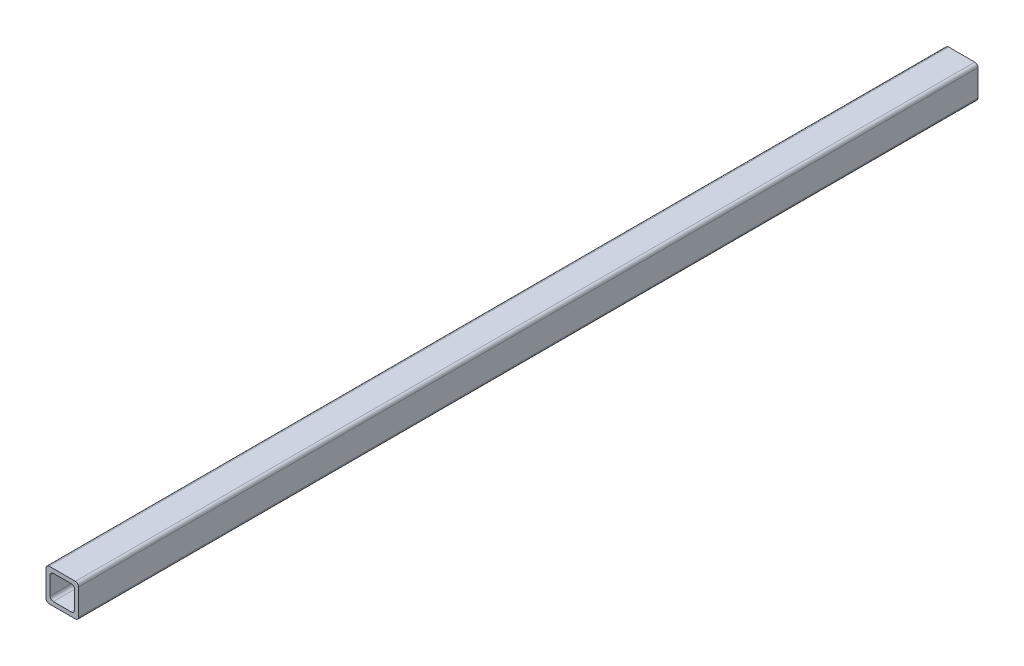
ISO-10303-21;
HEADER;
FILE_DESCRIPTION(('STEP AP214'),'2;1');
FILE_NAME('part.step','',(''),(''),'','','');
FILE_SCHEMA(('AUTOMOTIVE_DESIGN { 1 0 10303 214 1 1 1 1 }'));
ENDSEC;
DATA;
#1=APPLICATION_CONTEXT('core data for automotive mechanical design processes');
#2=APPLICATION_PROTOCOL_DEFINITION('international standard','automotive_design',2000,#1);
#3=PRODUCT_CONTEXT('',#1,'mechanical');
#4=PRODUCT('Part','Part','',(#3));
#5=PRODUCT_RELATED_PRODUCT_CATEGORY('part','',(#4));
#6=PRODUCT_DEFINITION_FORMATION('','',#4);
#7=PRODUCT_DEFINITION_CONTEXT('part definition',#1,'design');
#8=PRODUCT_DEFINITION('design','',#6,#7);
#9=PRODUCT_DEFINITION_SHAPE('','',#8);
#10=(LENGTH_UNIT() NAMED_UNIT(*) SI_UNIT(.MILLI.,.METRE.));
#11=(NAMED_UNIT(*) PLANE_ANGLE_UNIT() SI_UNIT($,.RADIAN.));
#12=(NAMED_UNIT(*) SI_UNIT($,.STERADIAN.) SOLID_ANGLE_UNIT());
#13=UNCERTAINTY_MEASURE_WITH_UNIT(LENGTH_MEASURE(1.E-05),#10,'distance_accuracy_value','');
#14=(GEOMETRIC_REPRESENTATION_CONTEXT(3) GLOBAL_UNCERTAINTY_ASSIGNED_CONTEXT((#13)) GLOBAL_UNIT_ASSIGNED_CONTEXT((#10,
#11,#12)) REPRESENTATION_CONTEXT('',''));
#15=CARTESIAN_POINT('',(0.,0.,0.));
#16=DIRECTION('',(0.,0.,1.));
#17=DIRECTION('',(1.,0.,0.));
#18=AXIS2_PLACEMENT_3D('',#15,#16,#17);
#19=CARTESIAN_POINT('',(10.2,-10.2,700.));
#20=DIRECTION('',(0.,0.,-1.));
#21=DIRECTION('',(-1.,0.,0.));
#22=AXIS2_PLACEMENT_3D('',#19,#20,#21);
#23=PLANE('',#22);
#24=CARTESIAN_POINT('',(10.2,-10.2,700.));
#25=DIRECTION('',(0.,0.,1.));
#26=DIRECTION('',(-1.,0.,0.));
#27=AXIS2_PLACEMENT_3D('',#24,#25,#26);
#28=CIRCLE('',#27,2.5);
#29=CARTESIAN_POINT('',(10.2,-12.7,700.));
#30=VERTEX_POINT('',#29);
#31=CARTESIAN_POINT('',(12.7,-10.2,700.));
#32=VERTEX_POINT('',#31);
#33=EDGE_CURVE('E215',#30,#32,#28,.T.);
#34=ORIENTED_EDGE('',*,*,#33,.T.);
#35=DIRECTION('',(0.,1.,0.));
#36=VECTOR('',#35,1.);
#37=CARTESIAN_POINT('',(12.7,-10.2,700.));
#38=LINE('',#37,#36);
#39=CARTESIAN_POINT('',(12.7,10.2,700.));
#40=VERTEX_POINT('',#39);
#41=EDGE_CURVE('E218',#32,#40,#38,.T.);
#42=ORIENTED_EDGE('',*,*,#41,.T.);
#43=CARTESIAN_POINT('',(10.2,10.2,700.));
#44=DIRECTION('',(0.,0.,1.));
#45=DIRECTION('',(1.,0.,0.));
#46=AXIS2_PLACEMENT_3D('',#43,#44,#45);
#47=CIRCLE('',#46,2.5);
#48=CARTESIAN_POINT('',(10.2,12.7,700.));
#49=VERTEX_POINT('',#48);
#50=EDGE_CURVE('E221',#40,#49,#47,.T.);
#51=ORIENTED_EDGE('',*,*,#50,.T.);
#52=DIRECTION('',(-1.,0.,0.));
#53=VECTOR('',#52,1.);
#54=CARTESIAN_POINT('',(-10.2,12.7,700.));
#55=LINE('',#54,#53);
#56=CARTESIAN_POINT('',(-10.2,12.7,700.));
#57=VERTEX_POINT('',#56);
#58=EDGE_CURVE('E223',#49,#57,#55,.T.);
#59=ORIENTED_EDGE('',*,*,#58,.T.);
#60=CARTESIAN_POINT('',(-10.2,10.2,700.));
#61=DIRECTION('',(0.,0.,1.));
#62=DIRECTION('',(1.,0.,0.));
#63=AXIS2_PLACEMENT_3D('',#60,#61,#62);
#64=CIRCLE('',#63,2.5);
#65=CARTESIAN_POINT('',(-12.7,10.2,700.));
#66=VERTEX_POINT('',#65);
#67=EDGE_CURVE('E225',#57,#66,#64,.T.);
#68=ORIENTED_EDGE('',*,*,#67,.T.);
#69=DIRECTION('',(0.,-1.,0.));
#70=VECTOR('',#69,1.);
#71=CARTESIAN_POINT('',(-12.7,-10.2,700.));
#72=LINE('',#71,#70);
#73=CARTESIAN_POINT('',(-12.7,-10.2,700.));
#74=VERTEX_POINT('',#73);
#75=EDGE_CURVE('E227',#66,#74,#72,.T.);
#76=ORIENTED_EDGE('',*,*,#75,.T.);
#77=CARTESIAN_POINT('',(-10.2,-10.2,700.));
#78=DIRECTION('',(0.,0.,1.));
#79=DIRECTION('',(-1.,0.,0.));
#80=AXIS2_PLACEMENT_3D('',#77,#78,#79);
#81=CIRCLE('',#80,2.5);
#82=CARTESIAN_POINT('',(-10.2,-12.7,700.));
#83=VERTEX_POINT('',#82);
#84=EDGE_CURVE('E229',#74,#83,#81,.T.);
#85=ORIENTED_EDGE('',*,*,#84,.T.);
#86=DIRECTION('',(1.,0.,0.));
#87=VECTOR('',#86,1.);
#88=CARTESIAN_POINT('',(-10.2,-12.7,700.));
#89=LINE('',#88,#87);
#90=EDGE_CURVE('E231',#83,#30,#89,.T.);
#91=ORIENTED_EDGE('',*,*,#90,.T.);
#92=EDGE_LOOP('',(#34,#42,#51,#59,#68,#76,#85,#91));
#93=FACE_BOUND('',#92,.T.);
#94=CARTESIAN_POINT('',(-7.02500000000001,-7.02499999999998,700.));
#95=DIRECTION('',(0.,0.,1.));
#96=DIRECTION('',(-1.,0.,0.));
#97=AXIS2_PLACEMENT_3D('',#94,#95,#96);
#98=CIRCLE('',#97,2.5);
#99=CARTESIAN_POINT('',(-9.52500000000001,-7.02499999999998,700.));
#100=VERTEX_POINT('',#99);
#101=CARTESIAN_POINT('',(-7.02500000000001,-9.52499999999998,700.));
#102=VERTEX_POINT('',#101);
#103=EDGE_CURVE('E150',#100,#102,#98,.T.);
#104=ORIENTED_EDGE('',*,*,#103,.F.);
#105=DIRECTION('',(0.,-1.,0.));
#106=VECTOR('',#105,1.);
#107=CARTESIAN_POINT('',(-9.52500000000001,-7.02499999999998,700.));
#108=LINE('',#107,#106);
#109=CARTESIAN_POINT('',(-9.52500000000001,7.025,700.));
#110=VERTEX_POINT('',#109);
#111=EDGE_CURVE('E183',#110,#100,#108,.T.);
#112=ORIENTED_EDGE('',*,*,#111,.F.);
#113=CARTESIAN_POINT('',(-7.025,7.025,700.));
#114=DIRECTION('',(0.,0.,1.));
#115=DIRECTION('',(-1.,0.,0.));
#116=AXIS2_PLACEMENT_3D('',#113,#114,#115);
#117=CIRCLE('',#116,2.5);
#118=CARTESIAN_POINT('',(-7.025,9.52500000000001,700.));
#119=VERTEX_POINT('',#118);
#120=EDGE_CURVE('E181',#119,#110,#117,.T.);
#121=ORIENTED_EDGE('',*,*,#120,.F.);
#122=DIRECTION('',(-1.,0.,0.));
#123=VECTOR('',#122,1.);
#124=CARTESIAN_POINT('',(-7.025,9.52500000000001,700.));
#125=LINE('',#124,#123);
#126=CARTESIAN_POINT('',(7.02499999999999,9.52500000000001,700.));
#127=VERTEX_POINT('',#126);
#128=EDGE_CURVE('E179',#127,#119,#125,.T.);
#129=ORIENTED_EDGE('',*,*,#128,.F.);
#130=CARTESIAN_POINT('',(7.02499999999999,7.025,700.));
#131=DIRECTION('',(0.,0.,1.));
#132=DIRECTION('',(1.,0.,0.));
#133=AXIS2_PLACEMENT_3D('',#130,#131,#132);
#134=CIRCLE('',#133,2.5);
#135=CARTESIAN_POINT('',(9.52499999999999,7.025,700.));
#136=VERTEX_POINT('',#135);
#137=EDGE_CURVE('E177',#136,#127,#134,.T.);
#138=ORIENTED_EDGE('',*,*,#137,.F.);
#139=DIRECTION('',(0.,1.,0.));
#140=VECTOR('',#139,1.);
#141=CARTESIAN_POINT('',(9.52499999999999,-7.02499999999998,700.));
#142=LINE('',#141,#140);
#143=CARTESIAN_POINT('',(9.52499999999999,-7.02499999999998,700.));
#144=VERTEX_POINT('',#143);
#145=EDGE_CURVE('E173',#144,#136,#142,.T.);
#146=ORIENTED_EDGE('',*,*,#145,.F.);
#147=CARTESIAN_POINT('',(7.02499999999999,-7.02499999999998,700.));
#148=DIRECTION('',(0.,0.,1.));
#149=DIRECTION('',(1.,0.,0.));
#150=AXIS2_PLACEMENT_3D('',#147,#148,#149);
#151=CIRCLE('',#150,2.5);
#152=CARTESIAN_POINT('',(7.02499999999999,-9.52499999999998,700.));
#153=VERTEX_POINT('',#152);
#154=EDGE_CURVE('E171',#153,#144,#151,.T.);
#155=ORIENTED_EDGE('',*,*,#154,.F.);
#156=DIRECTION('',(1.,0.,0.));
#157=VECTOR('',#156,1.);
#158=CARTESIAN_POINT('',(-7.02500000000001,-9.52499999999998,700.));
#159=LINE('',#158,#157);
#160=EDGE_CURVE('E158',#102,#153,#159,.T.);
#161=ORIENTED_EDGE('',*,*,#160,.F.);
#162=EDGE_LOOP('',(#104,#112,#121,#129,#138,#146,#155,#161));
#163=FACE_BOUND('',#162,.T.);
#164=ADVANCED_FACE('F37',(#93,#163),#23,.F.);
#165=CARTESIAN_POINT('',(10.2,-10.2,0.));
#166=DIRECTION('',(0.,0.,-1.));
#167=DIRECTION('',(-1.,0.,0.));
#168=AXIS2_PLACEMENT_3D('',#165,#166,#167);
#169=PLANE('',#168);
#170=CARTESIAN_POINT('',(10.2,-10.2,0.));
#171=DIRECTION('',(0.,0.,1.));
#172=DIRECTION('',(-1.,0.,0.));
#173=AXIS2_PLACEMENT_3D('',#170,#171,#172);
#174=CIRCLE('',#173,2.5);
#175=CARTESIAN_POINT('',(10.2,-12.7,0.));
#176=VERTEX_POINT('',#175);
#177=CARTESIAN_POINT('',(12.7,-10.2,0.));
#178=VERTEX_POINT('',#177);
#179=EDGE_CURVE('E166',#176,#178,#174,.T.);
#180=ORIENTED_EDGE('',*,*,#179,.F.);
#181=DIRECTION('',(1.,0.,0.));
#182=VECTOR('',#181,1.);
#183=CARTESIAN_POINT('',(-10.2,-12.7,0.));
#184=LINE('',#183,#182);
#185=CARTESIAN_POINT('',(-10.2,-12.7,0.));
#186=VERTEX_POINT('',#185);
#187=EDGE_CURVE('E219',#186,#176,#184,.T.);
#188=ORIENTED_EDGE('',*,*,#187,.F.);
#189=CARTESIAN_POINT('',(-10.2,-10.2,0.));
#190=DIRECTION('',(0.,0.,1.));
#191=DIRECTION('',(-1.,0.,0.));
#192=AXIS2_PLACEMENT_3D('',#189,#190,#191);
#193=CIRCLE('',#192,2.5);
#194=CARTESIAN_POINT('',(-12.7,-10.2,0.));
#195=VERTEX_POINT('',#194);
#196=EDGE_CURVE('E246',#195,#186,#193,.T.);
#197=ORIENTED_EDGE('',*,*,#196,.F.);
#198=DIRECTION('',(0.,-1.,0.));
#199=VECTOR('',#198,1.);
#200=CARTESIAN_POINT('',(-12.7,-10.2,0.));
#201=LINE('',#200,#199);
#202=CARTESIAN_POINT('',(-12.7,10.2,0.));
#203=VERTEX_POINT('',#202);
#204=EDGE_CURVE('E244',#203,#195,#201,.T.);
#205=ORIENTED_EDGE('',*,*,#204,.F.);
#206=CARTESIAN_POINT('',(-10.2,10.2,0.));
#207=DIRECTION('',(0.,0.,1.));
#208=DIRECTION('',(1.,0.,0.));
#209=AXIS2_PLACEMENT_3D('',#206,#207,#208);
#210=CIRCLE('',#209,2.5);
#211=CARTESIAN_POINT('',(-10.2,12.7,0.));
#212=VERTEX_POINT('',#211);
#213=EDGE_CURVE('E242',#212,#203,#210,.T.);
#214=ORIENTED_EDGE('',*,*,#213,.F.);
#215=DIRECTION('',(-1.,0.,0.));
#216=VECTOR('',#215,1.);
#217=CARTESIAN_POINT('',(-10.2,12.7,0.));
#218=LINE('',#217,#216);
#219=CARTESIAN_POINT('',(10.2,12.7,0.));
#220=VERTEX_POINT('',#219);
#221=EDGE_CURVE('E240',#220,#212,#218,.T.);
#222=ORIENTED_EDGE('',*,*,#221,.F.);
#223=CARTESIAN_POINT('',(10.2,10.2,0.));
#224=DIRECTION('',(0.,0.,1.));
#225=DIRECTION('',(1.,0.,0.));
#226=AXIS2_PLACEMENT_3D('',#223,#224,#225);
#227=CIRCLE('',#226,2.5);
#228=CARTESIAN_POINT('',(12.7,10.2,0.));
#229=VERTEX_POINT('',#228);
#230=EDGE_CURVE('E238',#229,#220,#227,.T.);
#231=ORIENTED_EDGE('',*,*,#230,.F.);
#232=DIRECTION('',(0.,1.,0.));
#233=VECTOR('',#232,1.);
#234=CARTESIAN_POINT('',(12.7,-10.2,0.));
#235=LINE('',#234,#233);
#236=EDGE_CURVE('E236',#178,#229,#235,.T.);
#237=ORIENTED_EDGE('',*,*,#236,.F.);
#238=EDGE_LOOP('',(#180,#188,#197,#205,#214,#222,#231,#237));
#239=FACE_BOUND('',#238,.T.);
#240=DIRECTION('',(0.,-1.,0.));
#241=VECTOR('',#240,1.);
#242=CARTESIAN_POINT('',(-9.52500000000001,-7.02499999999998,0.));
#243=LINE('',#242,#241);
#244=CARTESIAN_POINT('',(-9.52500000000001,7.02500000000001,0.));
#245=VERTEX_POINT('',#244);
#246=CARTESIAN_POINT('',(-9.52500000000001,-7.02499999999998,0.));
#247=VERTEX_POINT('',#246);
#248=EDGE_CURVE('E159',#245,#247,#243,.T.);
#249=ORIENTED_EDGE('',*,*,#248,.T.);
#250=CARTESIAN_POINT('',(-7.02500000000001,-7.02499999999998,0.));
#251=DIRECTION('',(0.,0.,1.));
#252=DIRECTION('',(-1.,0.,0.));
#253=AXIS2_PLACEMENT_3D('',#250,#251,#252);
#254=CIRCLE('',#253,2.5);
#255=CARTESIAN_POINT('',(-7.02500000000001,-9.52499999999998,0.));
#256=VERTEX_POINT('',#255);
#257=EDGE_CURVE('E60',#247,#256,#254,.T.);
#258=ORIENTED_EDGE('',*,*,#257,.T.);
#259=DIRECTION('',(1.,0.,0.));
#260=VECTOR('',#259,1.);
#261=CARTESIAN_POINT('',(-7.02500000000001,-9.52499999999998,0.));
#262=LINE('',#261,#260);
#263=CARTESIAN_POINT('',(7.02499999999999,-9.52499999999998,0.));
#264=VERTEX_POINT('',#263);
#265=EDGE_CURVE('E165',#256,#264,#262,.T.);
#266=ORIENTED_EDGE('',*,*,#265,.T.);
#267=CARTESIAN_POINT('',(7.02499999999999,-7.02499999999998,0.));
#268=DIRECTION('',(0.,0.,1.));
#269=DIRECTION('',(1.,0.,0.));
#270=AXIS2_PLACEMENT_3D('',#267,#268,#269);
#271=CIRCLE('',#270,2.5);
#272=CARTESIAN_POINT('',(9.52499999999999,-7.02499999999998,0.));
#273=VERTEX_POINT('',#272);
#274=EDGE_CURVE('E187',#264,#273,#271,.T.);
#275=ORIENTED_EDGE('',*,*,#274,.T.);
#276=DIRECTION('',(0.,1.,0.));
#277=VECTOR('',#276,1.);
#278=CARTESIAN_POINT('',(9.52499999999999,-7.02499999999998,0.));
#279=LINE('',#278,#277);
#280=CARTESIAN_POINT('',(9.52499999999999,7.025,0.));
#281=VERTEX_POINT('',#280);
#282=EDGE_CURVE('E190',#273,#281,#279,.T.);
#283=ORIENTED_EDGE('',*,*,#282,.T.);
#284=CARTESIAN_POINT('',(7.02499999999999,7.025,0.));
#285=DIRECTION('',(0.,0.,1.));
#286=DIRECTION('',(1.,0.,0.));
#287=AXIS2_PLACEMENT_3D('',#284,#285,#286);
#288=CIRCLE('',#287,2.5);
#289=CARTESIAN_POINT('',(7.02499999999999,9.52500000000001,0.));
#290=VERTEX_POINT('',#289);
#291=EDGE_CURVE('E193',#281,#290,#288,.T.);
#292=ORIENTED_EDGE('',*,*,#291,.T.);
#293=DIRECTION('',(-1.,0.,0.));
#294=VECTOR('',#293,1.);
#295=CARTESIAN_POINT('',(-7.025,9.52500000000001,0.));
#296=LINE('',#295,#294);
#297=CARTESIAN_POINT('',(-7.025,9.52500000000001,0.));
#298=VERTEX_POINT('',#297);
#299=EDGE_CURVE('E196',#290,#298,#296,.T.);
#300=ORIENTED_EDGE('',*,*,#299,.T.);
#301=CARTESIAN_POINT('',(-7.025,7.025,0.));
#302=DIRECTION('',(0.,0.,1.));
#303=DIRECTION('',(-1.,0.,0.));
#304=AXIS2_PLACEMENT_3D('',#301,#302,#303);
#305=CIRCLE('',#304,2.5);
#306=EDGE_CURVE('E199',#298,#245,#305,.T.);
#307=ORIENTED_EDGE('',*,*,#306,.T.);
#308=EDGE_LOOP('',(#249,#258,#266,#275,#283,#292,#300,#307));
#309=FACE_BOUND('',#308,.T.);
#310=ADVANCED_FACE('F276',(#239,#309),#169,.T.);
#311=CARTESIAN_POINT('',(10.2,-10.2,700.));
#312=DIRECTION('',(0.,0.,-1.));
#313=DIRECTION('',(-1.,0.,0.));
#314=AXIS2_PLACEMENT_3D('',#311,#312,#313);
#315=CYLINDRICAL_SURFACE('',#314,2.5);
#316=ORIENTED_EDGE('',*,*,#179,.T.);
#317=DIRECTION('',(0.,0.,-1.));
#318=VECTOR('',#317,1.);
#319=CARTESIAN_POINT('',(12.7,-10.2,700.));
#320=LINE('',#319,#318);
#321=EDGE_CURVE('E11',#32,#178,#320,.T.);
#322=ORIENTED_EDGE('',*,*,#321,.F.);
#323=ORIENTED_EDGE('',*,*,#33,.F.);
#324=DIRECTION('',(0.,0.,-1.));
#325=VECTOR('',#324,1.);
#326=CARTESIAN_POINT('',(10.2,-12.7,700.));
#327=LINE('',#326,#325);
#328=EDGE_CURVE('E233',#30,#176,#327,.T.);
#329=ORIENTED_EDGE('',*,*,#328,.T.);
#330=EDGE_LOOP('',(#316,#322,#323,#329));
#331=FACE_BOUND('',#330,.T.);
#332=ADVANCED_FACE('F39',(#331),#315,.T.);
#333=CARTESIAN_POINT('',(12.7,-10.2,700.));
#334=DIRECTION('',(-1.,0.,0.));
#335=DIRECTION('',(0.,-1.,0.));
#336=AXIS2_PLACEMENT_3D('',#333,#334,#335);
#337=PLANE('',#336);
#338=ORIENTED_EDGE('',*,*,#236,.T.);
#339=DIRECTION('',(0.,0.,-1.));
#340=VECTOR('',#339,1.);
#341=CARTESIAN_POINT('',(12.7,10.2,700.));
#342=LINE('',#341,#340);
#343=EDGE_CURVE('E45',#40,#229,#342,.T.);
#344=ORIENTED_EDGE('',*,*,#343,.F.);
#345=ORIENTED_EDGE('',*,*,#41,.F.);
#346=ORIENTED_EDGE('',*,*,#321,.T.);
#347=EDGE_LOOP('',(#338,#344,#345,#346));
#348=FACE_BOUND('',#347,.T.);
#349=ADVANCED_FACE('F293',(#348),#337,.F.);
#350=CARTESIAN_POINT('',(10.2,10.2,700.));
#351=DIRECTION('',(0.,0.,-1.));
#352=DIRECTION('',(-1.,0.,0.));
#353=AXIS2_PLACEMENT_3D('',#350,#351,#352);
#354=CYLINDRICAL_SURFACE('',#353,2.5);
#355=ORIENTED_EDGE('',*,*,#230,.T.);
#356=DIRECTION('',(0.,0.,-1.));
#357=VECTOR('',#356,1.);
#358=CARTESIAN_POINT('',(10.2,12.7,700.));
#359=LINE('',#358,#357);
#360=EDGE_CURVE('E263',#49,#220,#359,.T.);
#361=ORIENTED_EDGE('',*,*,#360,.F.);
#362=ORIENTED_EDGE('',*,*,#50,.F.);
#363=ORIENTED_EDGE('',*,*,#343,.T.);
#364=EDGE_LOOP('',(#355,#361,#362,#363));
#365=FACE_BOUND('',#364,.T.);
#366=ADVANCED_FACE('F270',(#365),#354,.T.);
#367=CARTESIAN_POINT('',(-10.2,12.7,700.));
#368=DIRECTION('',(0.,-1.,0.));
#369=DIRECTION('',(1.,0.,0.));
#370=AXIS2_PLACEMENT_3D('',#367,#368,#369);
#371=PLANE('',#370);
#372=ORIENTED_EDGE('',*,*,#221,.T.);
#373=DIRECTION('',(0.,0.,-1.));
#374=VECTOR('',#373,1.);
#375=CARTESIAN_POINT('',(-10.2,12.7,700.));
#376=LINE('',#375,#374);
#377=EDGE_CURVE('E260',#57,#212,#376,.T.);
#378=ORIENTED_EDGE('',*,*,#377,.F.);
#379=ORIENTED_EDGE('',*,*,#58,.F.);
#380=ORIENTED_EDGE('',*,*,#360,.T.);
#381=EDGE_LOOP('',(#372,#378,#379,#380));
#382=FACE_BOUND('',#381,.T.);
#383=ADVANCED_FACE('F282',(#382),#371,.F.);
#384=CARTESIAN_POINT('',(-10.2,10.2,700.));
#385=DIRECTION('',(0.,0.,-1.));
#386=DIRECTION('',(-1.,0.,0.));
#387=AXIS2_PLACEMENT_3D('',#384,#385,#386);
#388=CYLINDRICAL_SURFACE('',#387,2.5);
#389=ORIENTED_EDGE('',*,*,#213,.T.);
#390=DIRECTION('',(0.,0.,-1.));
#391=VECTOR('',#390,1.);
#392=CARTESIAN_POINT('',(-12.7,10.2,700.));
#393=LINE('',#392,#391);
#394=EDGE_CURVE('E257',#66,#203,#393,.T.);
#395=ORIENTED_EDGE('',*,*,#394,.F.);
#396=ORIENTED_EDGE('',*,*,#67,.F.);
#397=ORIENTED_EDGE('',*,*,#377,.T.);
#398=EDGE_LOOP('',(#389,#395,#396,#397));
#399=FACE_BOUND('',#398,.T.);
#400=ADVANCED_FACE('F286',(#399),#388,.T.);
#401=CARTESIAN_POINT('',(-12.7,-10.2,700.));
#402=DIRECTION('',(1.,0.,0.));
#403=DIRECTION('',(0.,0.,-1.));
#404=AXIS2_PLACEMENT_3D('',#401,#402,#403);
#405=PLANE('',#404);
#406=ORIENTED_EDGE('',*,*,#204,.T.);
#407=DIRECTION('',(0.,0.,-1.));
#408=VECTOR('',#407,1.);
#409=CARTESIAN_POINT('',(-12.7,-10.2,700.));
#410=LINE('',#409,#408);
#411=EDGE_CURVE('E254',#74,#195,#410,.T.);
#412=ORIENTED_EDGE('',*,*,#411,.F.);
#413=ORIENTED_EDGE('',*,*,#75,.F.);
#414=ORIENTED_EDGE('',*,*,#394,.T.);
#415=EDGE_LOOP('',(#406,#412,#413,#414));
#416=FACE_BOUND('',#415,.T.);
#417=ADVANCED_FACE('F306',(#416),#405,.F.);
#418=CARTESIAN_POINT('',(-10.2,-10.2,700.));
#419=DIRECTION('',(0.,0.,-1.));
#420=DIRECTION('',(-1.,0.,0.));
#421=AXIS2_PLACEMENT_3D('',#418,#419,#420);
#422=CYLINDRICAL_SURFACE('',#421,2.5);
#423=ORIENTED_EDGE('',*,*,#196,.T.);
#424=DIRECTION('',(0.,0.,-1.));
#425=VECTOR('',#424,1.);
#426=CARTESIAN_POINT('',(-10.2,-12.7,700.));
#427=LINE('',#426,#425);
#428=EDGE_CURVE('E251',#83,#186,#427,.T.);
#429=ORIENTED_EDGE('',*,*,#428,.F.);
#430=ORIENTED_EDGE('',*,*,#84,.F.);
#431=ORIENTED_EDGE('',*,*,#411,.T.);
#432=EDGE_LOOP('',(#423,#429,#430,#431));
#433=FACE_BOUND('',#432,.T.);
#434=ADVANCED_FACE('F304',(#433),#422,.T.);
#435=CARTESIAN_POINT('',(-10.2,-12.7,700.));
#436=DIRECTION('',(0.,1.,0.));
#437=DIRECTION('',(0.,0.,1.));
#438=AXIS2_PLACEMENT_3D('',#435,#436,#437);
#439=PLANE('',#438);
#440=ORIENTED_EDGE('',*,*,#187,.T.);
#441=ORIENTED_EDGE('',*,*,#328,.F.);
#442=ORIENTED_EDGE('',*,*,#90,.F.);
#443=ORIENTED_EDGE('',*,*,#428,.T.);
#444=EDGE_LOOP('',(#440,#441,#442,#443));
#445=FACE_BOUND('',#444,.T.);
#446=ADVANCED_FACE('F299',(#445),#439,.F.);
#447=CARTESIAN_POINT('',(-7.02500000000001,-7.02499999999998,700.));
#448=DIRECTION('',(0.,0.,-1.));
#449=DIRECTION('',(-1.,0.,0.));
#450=AXIS2_PLACEMENT_3D('',#447,#448,#449);
#451=CYLINDRICAL_SURFACE('',#450,2.5);
#452=ORIENTED_EDGE('',*,*,#257,.F.);
#453=DIRECTION('',(0.,0.,-1.));
#454=VECTOR('',#453,1.);
#455=CARTESIAN_POINT('',(-9.52500000000001,-7.02499999999998,700.));
#456=LINE('',#455,#454);
#457=EDGE_CURVE('E154',#100,#247,#456,.T.);
#458=ORIENTED_EDGE('',*,*,#457,.F.);
#459=ORIENTED_EDGE('',*,*,#103,.T.);
#460=DIRECTION('',(0.,0.,-1.));
#461=VECTOR('',#460,1.);
#462=CARTESIAN_POINT('',(-7.02500000000001,-9.52499999999998,700.));
#463=LINE('',#462,#461);
#464=EDGE_CURVE('E153',#102,#256,#463,.T.);
#465=ORIENTED_EDGE('',*,*,#464,.T.);
#466=EDGE_LOOP('',(#452,#458,#459,#465));
#467=FACE_BOUND('',#466,.T.);
#468=ADVANCED_FACE('F152',(#467),#451,.F.);
#469=CARTESIAN_POINT('',(-7.02500000000001,-9.52499999999998,700.));
#470=DIRECTION('',(0.,1.,0.));
#471=DIRECTION('',(0.,0.,1.));
#472=AXIS2_PLACEMENT_3D('',#469,#470,#471);
#473=PLANE('',#472);
#474=ORIENTED_EDGE('',*,*,#265,.F.);
#475=ORIENTED_EDGE('',*,*,#464,.F.);
#476=ORIENTED_EDGE('',*,*,#160,.T.);
#477=DIRECTION('',(0.,0.,-1.));
#478=VECTOR('',#477,1.);
#479=CARTESIAN_POINT('',(7.02499999999999,-9.52499999999998,700.));
#480=LINE('',#479,#478);
#481=EDGE_CURVE('E167',#153,#264,#480,.T.);
#482=ORIENTED_EDGE('',*,*,#481,.T.);
#483=EDGE_LOOP('',(#474,#475,#476,#482));
#484=FACE_BOUND('',#483,.T.);
#485=ADVANCED_FACE('F162',(#484),#473,.T.);
#486=CARTESIAN_POINT('',(7.02499999999999,-7.02499999999998,700.));
#487=DIRECTION('',(0.,0.,-1.));
#488=DIRECTION('',(-1.,0.,0.));
#489=AXIS2_PLACEMENT_3D('',#486,#487,#488);
#490=CYLINDRICAL_SURFACE('',#489,2.5);
#491=ORIENTED_EDGE('',*,*,#274,.F.);
#492=ORIENTED_EDGE('',*,*,#481,.F.);
#493=ORIENTED_EDGE('',*,*,#154,.T.);
#494=DIRECTION('',(0.,0.,-1.));
#495=VECTOR('',#494,1.);
#496=CARTESIAN_POINT('',(9.52499999999999,-7.02499999999998,700.));
#497=LINE('',#496,#495);
#498=EDGE_CURVE('E212',#144,#273,#497,.T.);
#499=ORIENTED_EDGE('',*,*,#498,.T.);
#500=EDGE_LOOP('',(#491,#492,#493,#499));
#501=FACE_BOUND('',#500,.T.);
#502=ADVANCED_FACE('F331',(#501),#490,.F.);
#503=CARTESIAN_POINT('',(9.52499999999999,-7.02499999999998,700.));
#504=DIRECTION('',(-1.,0.,0.));
#505=DIRECTION('',(0.,-1.,0.));
#506=AXIS2_PLACEMENT_3D('',#503,#504,#505);
#507=PLANE('',#506);
#508=ORIENTED_EDGE('',*,*,#282,.F.);
#509=ORIENTED_EDGE('',*,*,#498,.F.);
#510=ORIENTED_EDGE('',*,*,#145,.T.);
#511=DIRECTION('',(0.,0.,-1.));
#512=VECTOR('',#511,1.);
#513=CARTESIAN_POINT('',(9.52499999999999,7.025,700.));
#514=LINE('',#513,#512);
#515=EDGE_CURVE('E210',#136,#281,#514,.T.);
#516=ORIENTED_EDGE('',*,*,#515,.T.);
#517=EDGE_LOOP('',(#508,#509,#510,#516));
#518=FACE_BOUND('',#517,.T.);
#519=ADVANCED_FACE('F335',(#518),#507,.T.);
#520=CARTESIAN_POINT('',(7.02499999999999,7.025,700.));
#521=DIRECTION('',(0.,0.,-1.));
#522=DIRECTION('',(-1.,0.,0.));
#523=AXIS2_PLACEMENT_3D('',#520,#521,#522);
#524=CYLINDRICAL_SURFACE('',#523,2.5);
#525=ORIENTED_EDGE('',*,*,#291,.F.);
#526=ORIENTED_EDGE('',*,*,#515,.F.);
#527=ORIENTED_EDGE('',*,*,#137,.T.);
#528=DIRECTION('',(0.,0.,-1.));
#529=VECTOR('',#528,1.);
#530=CARTESIAN_POINT('',(7.02499999999999,9.52500000000001,700.));
#531=LINE('',#530,#529);
#532=EDGE_CURVE('E208',#127,#290,#531,.T.);
#533=ORIENTED_EDGE('',*,*,#532,.T.);
#534=EDGE_LOOP('',(#525,#526,#527,#533));
#535=FACE_BOUND('',#534,.T.);
#536=ADVANCED_FACE('F341',(#535),#524,.F.);
#537=CARTESIAN_POINT('',(-7.025,9.52500000000001,700.));
#538=DIRECTION('',(0.,-1.,0.));
#539=DIRECTION('',(0.,0.,-1.));
#540=AXIS2_PLACEMENT_3D('',#537,#538,#539);
#541=PLANE('',#540);
#542=ORIENTED_EDGE('',*,*,#299,.F.);
#543=ORIENTED_EDGE('',*,*,#532,.F.);
#544=ORIENTED_EDGE('',*,*,#128,.T.);
#545=DIRECTION('',(0.,0.,-1.));
#546=VECTOR('',#545,1.);
#547=CARTESIAN_POINT('',(-7.025,9.52500000000001,700.));
#548=LINE('',#547,#546);
#549=EDGE_CURVE('E206',#119,#298,#548,.T.);
#550=ORIENTED_EDGE('',*,*,#549,.T.);
#551=EDGE_LOOP('',(#542,#543,#544,#550));
#552=FACE_BOUND('',#551,.T.);
#553=ADVANCED_FACE('F345',(#552),#541,.T.);
#554=CARTESIAN_POINT('',(-7.025,7.025,700.));
#555=DIRECTION('',(0.,0.,-1.));
#556=DIRECTION('',(-1.,0.,0.));
#557=AXIS2_PLACEMENT_3D('',#554,#555,#556);
#558=CYLINDRICAL_SURFACE('',#557,2.5);
#559=ORIENTED_EDGE('',*,*,#306,.F.);
#560=ORIENTED_EDGE('',*,*,#549,.F.);
#561=ORIENTED_EDGE('',*,*,#120,.T.);
#562=DIRECTION('',(0.,0.,-1.));
#563=VECTOR('',#562,1.);
#564=CARTESIAN_POINT('',(-9.52500000000001,7.02500000000001,700.));
#565=LINE('',#564,#563);
#566=EDGE_CURVE('E52',#110,#245,#565,.T.);
#567=ORIENTED_EDGE('',*,*,#566,.T.);
#568=EDGE_LOOP('',(#559,#560,#561,#567));
#569=FACE_BOUND('',#568,.T.);
#570=ADVANCED_FACE('F349',(#569),#558,.F.);
#571=CARTESIAN_POINT('',(-9.52500000000001,-7.02499999999998,700.));
#572=DIRECTION('',(1.,0.,0.));
#573=DIRECTION('',(0.,0.,-1.));
#574=AXIS2_PLACEMENT_3D('',#571,#572,#573);
#575=PLANE('',#574);
#576=ORIENTED_EDGE('',*,*,#248,.F.);
#577=ORIENTED_EDGE('',*,*,#566,.F.);
#578=ORIENTED_EDGE('',*,*,#111,.T.);
#579=ORIENTED_EDGE('',*,*,#457,.T.);
#580=EDGE_LOOP('',(#576,#577,#578,#579));
#581=FACE_BOUND('',#580,.T.);
#582=ADVANCED_FACE('F353',(#581),#575,.T.);
#583=CLOSED_SHELL('',(#164,#310,#332,#349,#366,#383,#400,#417,#434,#446,#468,#485,#502,#519,
#536,#553,#570,#582));
#584=MANIFOLD_SOLID_BREP('B2',#583);
#585=ADVANCED_BREP_SHAPE_REPRESENTATION('',(#18,#584),#14);
#586=SHAPE_DEFINITION_REPRESENTATION(#9,#585);
ENDSEC;
END-ISO-10303-21;
